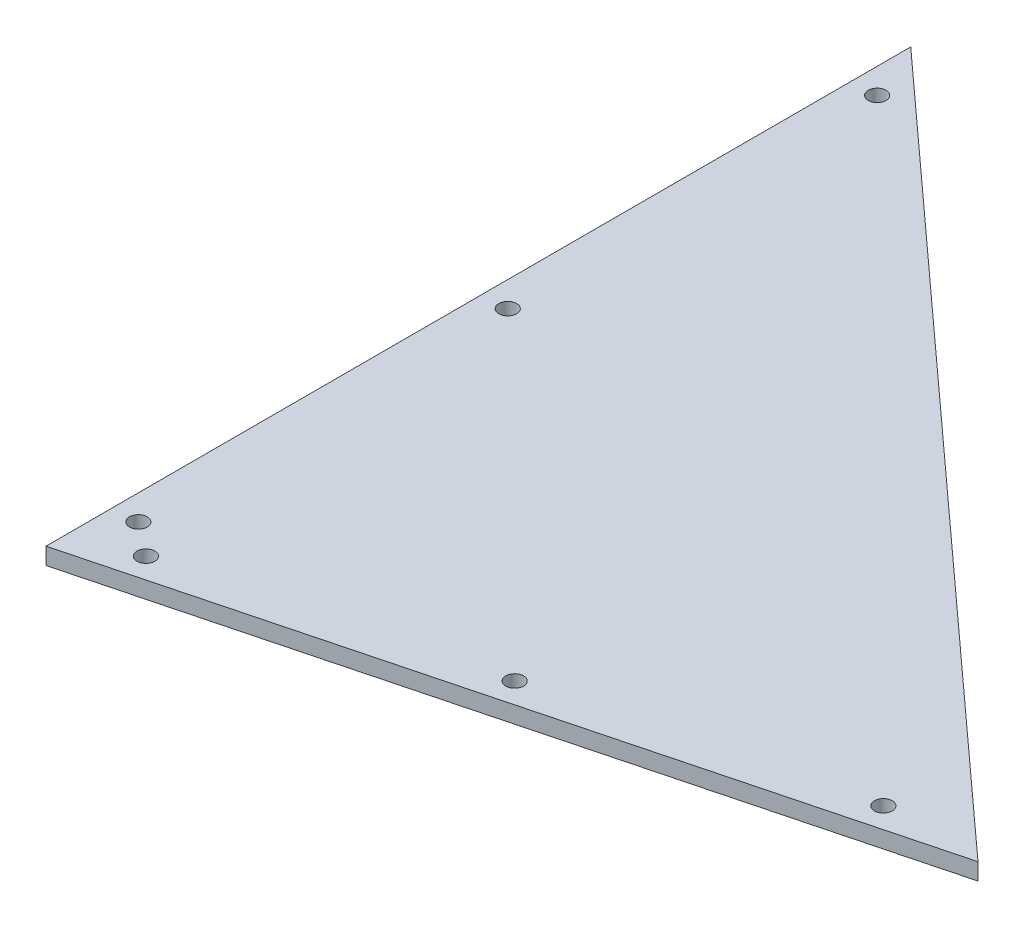
ISO-10303-21;
HEADER;
FILE_DESCRIPTION(('STEP AP214'),'2;1');
FILE_NAME('part.step','',(''),(''),'','','');
FILE_SCHEMA(('AUTOMOTIVE_DESIGN { 1 0 10303 214 1 1 1 1 }'));
ENDSEC;
DATA;
#1=APPLICATION_CONTEXT('core data for automotive mechanical design processes');
#2=APPLICATION_PROTOCOL_DEFINITION('international standard','automotive_design',2000,#1);
#3=PRODUCT_CONTEXT('',#1,'mechanical');
#4=PRODUCT('Part','Part','',(#3));
#5=PRODUCT_RELATED_PRODUCT_CATEGORY('part','',(#4));
#6=PRODUCT_DEFINITION_FORMATION('','',#4);
#7=PRODUCT_DEFINITION_CONTEXT('part definition',#1,'design');
#8=PRODUCT_DEFINITION('design','',#6,#7);
#9=PRODUCT_DEFINITION_SHAPE('','',#8);
#10=(LENGTH_UNIT() NAMED_UNIT(*) SI_UNIT(.MILLI.,.METRE.));
#11=(NAMED_UNIT(*) PLANE_ANGLE_UNIT() SI_UNIT($,.RADIAN.));
#12=(NAMED_UNIT(*) SI_UNIT($,.STERADIAN.) SOLID_ANGLE_UNIT());
#13=UNCERTAINTY_MEASURE_WITH_UNIT(LENGTH_MEASURE(1.E-05),#10,'distance_accuracy_value','');
#14=(GEOMETRIC_REPRESENTATION_CONTEXT(3) GLOBAL_UNCERTAINTY_ASSIGNED_CONTEXT((#13)) GLOBAL_UNIT_ASSIGNED_CONTEXT((#10,
#11,#12)) REPRESENTATION_CONTEXT('',''));
#15=CARTESIAN_POINT('',(0.,0.,0.));
#16=DIRECTION('',(0.,0.,1.));
#17=DIRECTION('',(1.,0.,0.));
#18=AXIS2_PLACEMENT_3D('',#15,#16,#17);
#19=CARTESIAN_POINT('',(279.58048014603,6.35,-72.886286407767));
#20=DIRECTION('',(-0.252267150325403,0.,-0.967657627917385));
#21=DIRECTION('',(-0.967657627917385,0.,0.252267150325403));
#22=AXIS2_PLACEMENT_3D('',#19,#20,#21);
#23=PLANE('',#22);
#24=DIRECTION('',(0.967657627917385,0.,-0.252267150325403));
#25=VECTOR('',#24,1.);
#26=CARTESIAN_POINT('',(279.58048014603,0.,-72.886286407767));
#27=LINE('',#26,#25);
#28=CARTESIAN_POINT('',(0.,0.,0.));
#29=VERTEX_POINT('',#28);
#30=CARTESIAN_POINT('',(279.58048014603,0.,-72.886286407767));
#31=VERTEX_POINT('',#30);
#32=EDGE_CURVE('E91',#29,#31,#27,.T.);
#33=ORIENTED_EDGE('',*,*,#32,.T.);
#34=DIRECTION('',(0.,-1.,0.));
#35=VECTOR('',#34,1.);
#36=CARTESIAN_POINT('',(279.58048014603,6.35,-72.886286407767));
#37=LINE('',#36,#35);
#38=CARTESIAN_POINT('',(279.58048014603,6.35,-72.886286407767));
#39=VERTEX_POINT('',#38);
#40=EDGE_CURVE('E12',#39,#31,#37,.T.);
#41=ORIENTED_EDGE('',*,*,#40,.F.);
#42=DIRECTION('',(0.967657627917385,0.,-0.252267150325403));
#43=VECTOR('',#42,1.);
#44=CARTESIAN_POINT('',(279.58048014603,6.35,-72.886286407767));
#45=LINE('',#44,#43);
#46=CARTESIAN_POINT('',(0.,6.35,0.));
#47=VERTEX_POINT('',#46);
#48=EDGE_CURVE('E83',#47,#39,#45,.T.);
#49=ORIENTED_EDGE('',*,*,#48,.F.);
#50=DIRECTION('',(0.,-1.,0.));
#51=VECTOR('',#50,1.);
#52=CARTESIAN_POINT('',(0.,6.35,0.));
#53=LINE('',#52,#51);
#54=EDGE_CURVE('E92',#47,#29,#53,.T.);
#55=ORIENTED_EDGE('',*,*,#54,.T.);
#56=EDGE_LOOP('',(#33,#41,#49,#55));
#57=FACE_BOUND('',#56,.T.);
#58=ADVANCED_FACE('F42',(#57),#23,.F.);
#59=CARTESIAN_POINT('',(0.,6.35,-327.025));
#60=DIRECTION('',(-0.672636044709146,0.,0.739973480172118));
#61=DIRECTION('',(0.739973480172118,0.,0.672636044709146));
#62=AXIS2_PLACEMENT_3D('',#59,#60,#61);
#63=PLANE('',#62);
#64=DIRECTION('',(-0.739973480172118,0.,-0.672636044709146));
#65=VECTOR('',#64,1.);
#66=CARTESIAN_POINT('',(0.,0.,-327.025));
#67=LINE('',#66,#65);
#68=CARTESIAN_POINT('',(0.,0.,-327.025));
#69=VERTEX_POINT('',#68);
#70=EDGE_CURVE('E70',#31,#69,#67,.T.);
#71=ORIENTED_EDGE('',*,*,#70,.T.);
#72=DIRECTION('',(0.,-1.,0.));
#73=VECTOR('',#72,1.);
#74=CARTESIAN_POINT('',(0.,6.35,-327.025));
#75=LINE('',#74,#73);
#76=CARTESIAN_POINT('',(0.,6.35,-327.025));
#77=VERTEX_POINT('',#76);
#78=EDGE_CURVE('E50',#77,#69,#75,.T.);
#79=ORIENTED_EDGE('',*,*,#78,.F.);
#80=DIRECTION('',(-0.739973480172118,0.,-0.672636044709146));
#81=VECTOR('',#80,1.);
#82=CARTESIAN_POINT('',(0.,6.35,-327.025));
#83=LINE('',#82,#81);
#84=EDGE_CURVE('E78',#39,#77,#83,.T.);
#85=ORIENTED_EDGE('',*,*,#84,.F.);
#86=ORIENTED_EDGE('',*,*,#40,.T.);
#87=EDGE_LOOP('',(#71,#79,#85,#86));
#88=FACE_BOUND('',#87,.T.);
#89=ADVANCED_FACE('F79',(#88),#63,.F.);
#90=CARTESIAN_POINT('',(0.,6.35,0.));
#91=DIRECTION('',(1.,0.,0.));
#92=DIRECTION('',(0.,0.,-1.));
#93=AXIS2_PLACEMENT_3D('',#90,#91,#92);
#94=PLANE('',#93);
#95=DIRECTION('',(0.,0.,1.));
#96=VECTOR('',#95,1.);
#97=CARTESIAN_POINT('',(0.,0.,0.));
#98=LINE('',#97,#96);
#99=EDGE_CURVE('E75',#69,#29,#98,.T.);
#100=ORIENTED_EDGE('',*,*,#99,.T.);
#101=ORIENTED_EDGE('',*,*,#54,.F.);
#102=DIRECTION('',(0.,0.,1.));
#103=VECTOR('',#102,1.);
#104=CARTESIAN_POINT('',(0.,6.35,0.));
#105=LINE('',#104,#103);
#106=EDGE_CURVE('E58',#77,#47,#105,.T.);
#107=ORIENTED_EDGE('',*,*,#106,.F.);
#108=ORIENTED_EDGE('',*,*,#78,.T.);
#109=EDGE_LOOP('',(#100,#101,#107,#108));
#110=FACE_BOUND('',#109,.T.);
#111=ADVANCED_FACE('F103',(#110),#94,.F.);
#112=CARTESIAN_POINT('',(0.,6.35,0.));
#113=DIRECTION('',(0.,-1.,0.));
#114=DIRECTION('',(0.,0.,-1.));
#115=AXIS2_PLACEMENT_3D('',#112,#113,#114);
#116=PLANE('',#115);
#117=CARTESIAN_POINT('',(243.382192884166,6.35,-73.2927950885654));
#118=DIRECTION('',(0.,1.,0.));
#119=DIRECTION('',(0.,0.,1.));
#120=AXIS2_PLACEMENT_3D('',#117,#118,#119);
#121=CIRCLE('',#120,3.36549999999999);
#122=CARTESIAN_POINT('',(243.382192884166,6.35,-69.9272950885654));
#123=VERTEX_POINT('',#122);
#124=EDGE_CURVE('E202',#123,#123,#121,.T.);
#125=ORIENTED_EDGE('',*,*,#124,.F.);
#126=EDGE_LOOP('',(#125));
#127=FACE_BOUND('',#126,.T.);
#128=CARTESIAN_POINT('',(132.778926013209,6.35,-44.4586598063719));
#129=DIRECTION('',(0.,1.,0.));
#130=DIRECTION('',(0.,0.,1.));
#131=AXIS2_PLACEMENT_3D('',#128,#129,#130);
#132=CIRCLE('',#131,3.36549999999999);
#133=CARTESIAN_POINT('',(132.778926013209,6.35,-41.0931598063719));
#134=VERTEX_POINT('',#133);
#135=EDGE_CURVE('E206',#134,#134,#132,.T.);
#136=ORIENTED_EDGE('',*,*,#135,.F.);
#137=EDGE_LOOP('',(#136));
#138=FACE_BOUND('',#137,.T.);
#139=CARTESIAN_POINT('',(22.1756591422521,6.35,-15.6245245241783));
#140=DIRECTION('',(0.,1.,0.));
#141=DIRECTION('',(0.,0.,1.));
#142=AXIS2_PLACEMENT_3D('',#139,#140,#141);
#143=CIRCLE('',#142,3.3655);
#144=CARTESIAN_POINT('',(22.1756591422521,6.35,-12.2590245241783));
#145=VERTEX_POINT('',#144);
#146=EDGE_CURVE('E221',#145,#145,#143,.T.);
#147=ORIENTED_EDGE('',*,*,#146,.F.);
#148=EDGE_LOOP('',(#147));
#149=FACE_BOUND('',#148,.T.);
#150=CARTESIAN_POINT('',(9.525,6.35,-304.8));
#151=DIRECTION('',(0.,1.,0.));
#152=DIRECTION('',(0.,0.,1.));
#153=AXIS2_PLACEMENT_3D('',#150,#151,#152);
#154=CIRCLE('',#153,3.3655);
#155=CARTESIAN_POINT('',(9.525,6.35,-301.4345));
#156=VERTEX_POINT('',#155);
#157=EDGE_CURVE('E229',#156,#156,#154,.T.);
#158=ORIENTED_EDGE('',*,*,#157,.F.);
#159=EDGE_LOOP('',(#158));
#160=FACE_BOUND('',#159,.T.);
#161=CARTESIAN_POINT('',(9.525,6.35,-165.1));
#162=DIRECTION('',(0.,1.,0.));
#163=DIRECTION('',(0.,0.,1.));
#164=AXIS2_PLACEMENT_3D('',#161,#162,#163);
#165=CIRCLE('',#164,3.3655);
#166=CARTESIAN_POINT('',(9.525,6.35,-161.7345));
#167=VERTEX_POINT('',#166);
#168=EDGE_CURVE('E239',#167,#167,#165,.T.);
#169=ORIENTED_EDGE('',*,*,#168,.F.);
#170=EDGE_LOOP('',(#169));
#171=FACE_BOUND('',#170,.T.);
#172=CARTESIAN_POINT('',(9.525,6.35,-25.4));
#173=DIRECTION('',(0.,1.,0.));
#174=DIRECTION('',(0.,0.,1.));
#175=AXIS2_PLACEMENT_3D('',#172,#173,#174);
#176=CIRCLE('',#175,3.3655);
#177=CARTESIAN_POINT('',(9.525,6.35,-22.0345));
#178=VERTEX_POINT('',#177);
#179=EDGE_CURVE('E98',#178,#178,#176,.T.);
#180=ORIENTED_EDGE('',*,*,#179,.F.);
#181=EDGE_LOOP('',(#180));
#182=FACE_BOUND('',#181,.T.);
#183=ORIENTED_EDGE('',*,*,#48,.T.);
#184=ORIENTED_EDGE('',*,*,#84,.T.);
#185=ORIENTED_EDGE('',*,*,#106,.T.);
#186=EDGE_LOOP('',(#183,#184,#185));
#187=FACE_BOUND('',#186,.T.);
#188=ADVANCED_FACE('F86',(#127,#138,#149,#160,#171,#182,#187),#116,.F.);
#189=CARTESIAN_POINT('',(0.,0.,0.));
#190=DIRECTION('',(0.,-1.,0.));
#191=DIRECTION('',(0.,0.,-1.));
#192=AXIS2_PLACEMENT_3D('',#189,#190,#191);
#193=PLANE('',#192);
#194=CARTESIAN_POINT('',(243.382192884166,0.,-73.2927950885654));
#195=DIRECTION('',(0.,1.,0.));
#196=DIRECTION('',(0.,0.,1.));
#197=AXIS2_PLACEMENT_3D('',#194,#195,#196);
#198=CIRCLE('',#197,3.36549999999999);
#199=CARTESIAN_POINT('',(243.382192884166,0.,-69.9272950885654));
#200=VERTEX_POINT('',#199);
#201=EDGE_CURVE('E199',#200,#200,#198,.T.);
#202=ORIENTED_EDGE('',*,*,#201,.T.);
#203=EDGE_LOOP('',(#202));
#204=FACE_BOUND('',#203,.T.);
#205=CARTESIAN_POINT('',(132.778926013209,0.,-44.4586598063719));
#206=DIRECTION('',(0.,1.,0.));
#207=DIRECTION('',(0.,0.,1.));
#208=AXIS2_PLACEMENT_3D('',#205,#206,#207);
#209=CIRCLE('',#208,3.36549999999999);
#210=CARTESIAN_POINT('',(132.778926013209,0.,-41.0931598063719));
#211=VERTEX_POINT('',#210);
#212=EDGE_CURVE('E219',#211,#211,#209,.T.);
#213=ORIENTED_EDGE('',*,*,#212,.T.);
#214=EDGE_LOOP('',(#213));
#215=FACE_BOUND('',#214,.T.);
#216=CARTESIAN_POINT('',(22.1756591422521,0.,-15.6245245241783));
#217=DIRECTION('',(0.,1.,0.));
#218=DIRECTION('',(0.,0.,1.));
#219=AXIS2_PLACEMENT_3D('',#216,#217,#218);
#220=CIRCLE('',#219,3.3655);
#221=CARTESIAN_POINT('',(22.1756591422521,0.,-12.2590245241783));
#222=VERTEX_POINT('',#221);
#223=EDGE_CURVE('E226',#222,#222,#220,.T.);
#224=ORIENTED_EDGE('',*,*,#223,.T.);
#225=EDGE_LOOP('',(#224));
#226=FACE_BOUND('',#225,.T.);
#227=CARTESIAN_POINT('',(9.525,0.,-304.8));
#228=DIRECTION('',(0.,1.,0.));
#229=DIRECTION('',(0.,0.,1.));
#230=AXIS2_PLACEMENT_3D('',#227,#228,#229);
#231=CIRCLE('',#230,3.3655);
#232=CARTESIAN_POINT('',(9.525,0.,-301.4345));
#233=VERTEX_POINT('',#232);
#234=EDGE_CURVE('E234',#233,#233,#231,.T.);
#235=ORIENTED_EDGE('',*,*,#234,.T.);
#236=EDGE_LOOP('',(#235));
#237=FACE_BOUND('',#236,.T.);
#238=CARTESIAN_POINT('',(9.525,0.,-165.1));
#239=DIRECTION('',(0.,1.,0.));
#240=DIRECTION('',(0.,0.,1.));
#241=AXIS2_PLACEMENT_3D('',#238,#239,#240);
#242=CIRCLE('',#241,3.3655);
#243=CARTESIAN_POINT('',(9.525,0.,-161.7345));
#244=VERTEX_POINT('',#243);
#245=EDGE_CURVE('E244',#244,#244,#242,.T.);
#246=ORIENTED_EDGE('',*,*,#245,.T.);
#247=EDGE_LOOP('',(#246));
#248=FACE_BOUND('',#247,.T.);
#249=CARTESIAN_POINT('',(9.525,0.,-25.4));
#250=DIRECTION('',(0.,1.,0.));
#251=DIRECTION('',(0.,0.,1.));
#252=AXIS2_PLACEMENT_3D('',#249,#250,#251);
#253=CIRCLE('',#252,3.3655);
#254=CARTESIAN_POINT('',(9.525,0.,-22.0345));
#255=VERTEX_POINT('',#254);
#256=EDGE_CURVE('E94',#255,#255,#253,.T.);
#257=ORIENTED_EDGE('',*,*,#256,.T.);
#258=EDGE_LOOP('',(#257));
#259=FACE_BOUND('',#258,.T.);
#260=ORIENTED_EDGE('',*,*,#32,.F.);
#261=ORIENTED_EDGE('',*,*,#99,.F.);
#262=ORIENTED_EDGE('',*,*,#70,.F.);
#263=EDGE_LOOP('',(#260,#261,#262));
#264=FACE_BOUND('',#263,.T.);
#265=ADVANCED_FACE('F104',(#204,#215,#226,#237,#248,#259,#264),#193,.T.);
#266=CARTESIAN_POINT('',(9.525,0.,-25.4));
#267=DIRECTION('',(0.,1.,0.));
#268=DIRECTION('',(0.,0.,1.));
#269=AXIS2_PLACEMENT_3D('',#266,#267,#268);
#270=CYLINDRICAL_SURFACE('',#269,3.3655);
#271=ORIENTED_EDGE('',*,*,#256,.F.);
#272=EDGE_LOOP('',(#271));
#273=FACE_BOUND('',#272,.T.);
#274=ORIENTED_EDGE('',*,*,#179,.T.);
#275=EDGE_LOOP('',(#274));
#276=FACE_BOUND('',#275,.T.);
#277=ADVANCED_FACE('F106',(#273,#276),#270,.F.);
#278=CARTESIAN_POINT('',(9.525,0.,-165.1));
#279=DIRECTION('',(0.,1.,0.));
#280=DIRECTION('',(0.,0.,1.));
#281=AXIS2_PLACEMENT_3D('',#278,#279,#280);
#282=CYLINDRICAL_SURFACE('',#281,3.3655);
#283=ORIENTED_EDGE('',*,*,#245,.F.);
#284=EDGE_LOOP('',(#283));
#285=FACE_BOUND('',#284,.T.);
#286=ORIENTED_EDGE('',*,*,#168,.T.);
#287=EDGE_LOOP('',(#286));
#288=FACE_BOUND('',#287,.T.);
#289=ADVANCED_FACE('F113',(#285,#288),#282,.F.);
#290=CARTESIAN_POINT('',(9.525,0.,-304.8));
#291=DIRECTION('',(0.,1.,0.));
#292=DIRECTION('',(0.,0.,1.));
#293=AXIS2_PLACEMENT_3D('',#290,#291,#292);
#294=CYLINDRICAL_SURFACE('',#293,3.3655);
#295=ORIENTED_EDGE('',*,*,#234,.F.);
#296=EDGE_LOOP('',(#295));
#297=FACE_BOUND('',#296,.T.);
#298=ORIENTED_EDGE('',*,*,#157,.T.);
#299=EDGE_LOOP('',(#298));
#300=FACE_BOUND('',#299,.T.);
#301=ADVANCED_FACE('F153',(#297,#300),#294,.F.);
#302=CARTESIAN_POINT('',(22.1756591422521,0.,-15.6245245241783));
#303=DIRECTION('',(0.,1.,0.));
#304=DIRECTION('',(0.,0.,1.));
#305=AXIS2_PLACEMENT_3D('',#302,#303,#304);
#306=CYLINDRICAL_SURFACE('',#305,3.3655);
#307=ORIENTED_EDGE('',*,*,#223,.F.);
#308=EDGE_LOOP('',(#307));
#309=FACE_BOUND('',#308,.T.);
#310=ORIENTED_EDGE('',*,*,#146,.T.);
#311=EDGE_LOOP('',(#310));
#312=FACE_BOUND('',#311,.T.);
#313=ADVANCED_FACE('F163',(#309,#312),#306,.F.);
#314=CARTESIAN_POINT('',(132.778926013209,0.,-44.4586598063719));
#315=DIRECTION('',(0.,1.,0.));
#316=DIRECTION('',(0.,0.,1.));
#317=AXIS2_PLACEMENT_3D('',#314,#315,#316);
#318=CYLINDRICAL_SURFACE('',#317,3.36549999999999);
#319=ORIENTED_EDGE('',*,*,#212,.F.);
#320=EDGE_LOOP('',(#319));
#321=FACE_BOUND('',#320,.T.);
#322=ORIENTED_EDGE('',*,*,#135,.T.);
#323=EDGE_LOOP('',(#322));
#324=FACE_BOUND('',#323,.T.);
#325=ADVANCED_FACE('F173',(#321,#324),#318,.F.);
#326=CARTESIAN_POINT('',(243.382192884166,0.,-73.2927950885654));
#327=DIRECTION('',(0.,1.,0.));
#328=DIRECTION('',(0.,0.,1.));
#329=AXIS2_PLACEMENT_3D('',#326,#327,#328);
#330=CYLINDRICAL_SURFACE('',#329,3.36549999999999);
#331=ORIENTED_EDGE('',*,*,#201,.F.);
#332=EDGE_LOOP('',(#331));
#333=FACE_BOUND('',#332,.T.);
#334=ORIENTED_EDGE('',*,*,#124,.T.);
#335=EDGE_LOOP('',(#334));
#336=FACE_BOUND('',#335,.T.);
#337=ADVANCED_FACE('F183',(#333,#336),#330,.F.);
#338=CLOSED_SHELL('',(#58,#89,#111,#188,#265,#277,#289,#301,#313,#325,#337));
#339=MANIFOLD_SOLID_BREP('B2',#338);
#340=ADVANCED_BREP_SHAPE_REPRESENTATION('',(#18,#339),#14);
#341=SHAPE_DEFINITION_REPRESENTATION(#9,#340);
ENDSEC;
END-ISO-10303-21;
